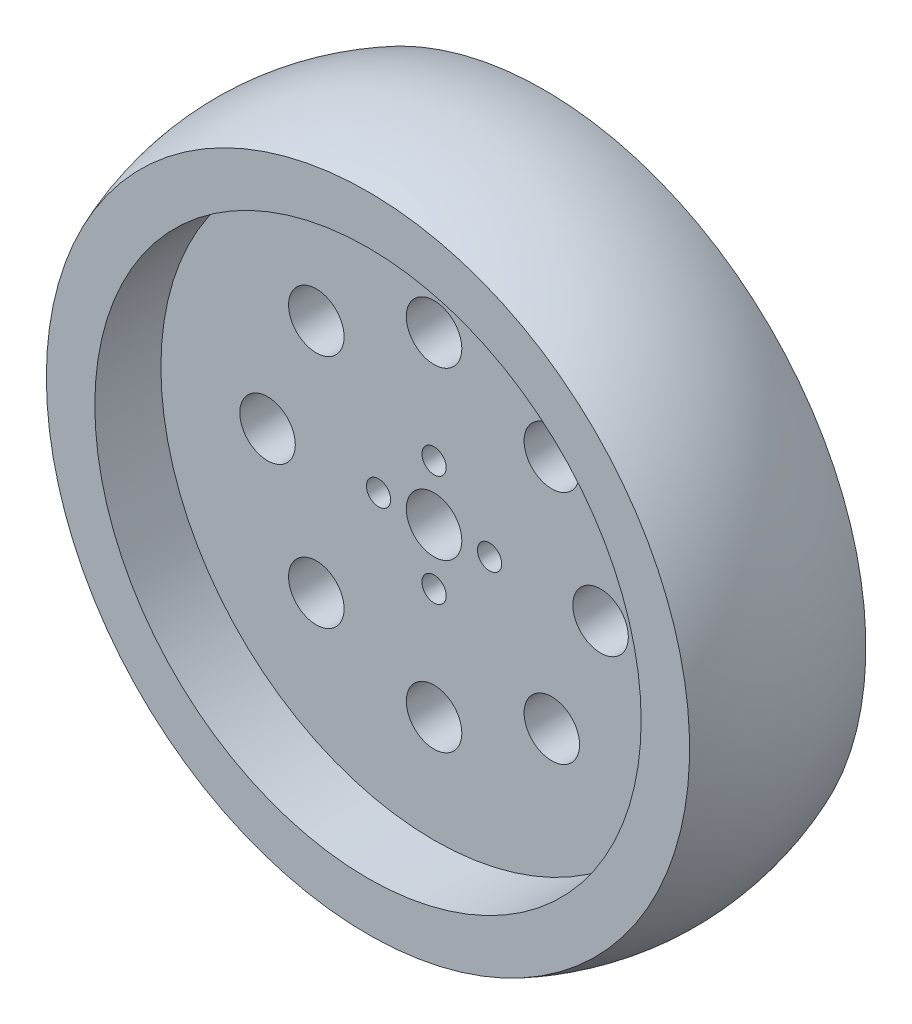
ISO-10303-21;
HEADER;
FILE_DESCRIPTION(('STEP AP214'),'2;1');
FILE_NAME('part.step','',(''),(''),'','','');
FILE_SCHEMA(('AUTOMOTIVE_DESIGN { 1 0 10303 214 1 1 1 1 }'));
ENDSEC;
DATA;
#1=APPLICATION_CONTEXT('core data for automotive mechanical design processes');
#2=APPLICATION_PROTOCOL_DEFINITION('international standard','automotive_design',2000,#1);
#3=PRODUCT_CONTEXT('',#1,'mechanical');
#4=PRODUCT('Part','Part','',(#3));
#5=PRODUCT_RELATED_PRODUCT_CATEGORY('part','',(#4));
#6=PRODUCT_DEFINITION_FORMATION('','',#4);
#7=PRODUCT_DEFINITION_CONTEXT('part definition',#1,'design');
#8=PRODUCT_DEFINITION('design','',#6,#7);
#9=PRODUCT_DEFINITION_SHAPE('','',#8);
#10=(LENGTH_UNIT() NAMED_UNIT(*) SI_UNIT(.MILLI.,.METRE.));
#11=(NAMED_UNIT(*) PLANE_ANGLE_UNIT() SI_UNIT($,.RADIAN.));
#12=(NAMED_UNIT(*) SI_UNIT($,.STERADIAN.) SOLID_ANGLE_UNIT());
#13=UNCERTAINTY_MEASURE_WITH_UNIT(LENGTH_MEASURE(1.E-05),#10,'distance_accuracy_value','');
#14=(GEOMETRIC_REPRESENTATION_CONTEXT(3) GLOBAL_UNCERTAINTY_ASSIGNED_CONTEXT((#13)) GLOBAL_UNIT_ASSIGNED_CONTEXT((#10,
#11,#12)) REPRESENTATION_CONTEXT('',''));
#15=CARTESIAN_POINT('',(0.,0.,0.));
#16=DIRECTION('',(0.,0.,1.));
#17=DIRECTION('',(1.,0.,0.));
#18=AXIS2_PLACEMENT_3D('',#15,#16,#17);
#19=CARTESIAN_POINT('',(-25.2639135472918,11.9697290917884,-7.500634435137));
#20=DIRECTION('',(0.,0.,-1.));
#21=DIRECTION('',(-1.,0.,0.));
#22=AXIS2_PLACEMENT_3D('',#19,#20,#21);
#23=PLANE('',#22);
#24=CARTESIAN_POINT('',(-25.2639135472918,11.9697290917884,-7.500634435137));
#25=DIRECTION('',(0.,0.,-1.));
#26=DIRECTION('',(-1.,0.,0.));
#27=AXIS2_PLACEMENT_3D('',#24,#25,#26);
#28=CIRCLE('',#27,46.355);
#29=CARTESIAN_POINT('',(-71.6189135472918,11.9697290917884,-7.500634435137));
#30=VERTEX_POINT('',#29);
#31=EDGE_CURVE('E310',#30,#30,#28,.F.);
#32=ORIENTED_EDGE('',*,*,#31,.F.);
#33=EDGE_LOOP('',(#32));
#34=FACE_BOUND('',#33,.T.);
#35=CARTESIAN_POINT('',(-25.2639135472918,11.9697290917884,-7.500634435137));
#36=DIRECTION('',(0.,0.,-1.));
#37=DIRECTION('',(-1.,0.,0.));
#38=AXIS2_PLACEMENT_3D('',#35,#36,#37);
#39=CIRCLE('',#38,39.37);
#40=CARTESIAN_POINT('',(-64.6339135472918,11.9697290917884,-7.500634435137));
#41=VERTEX_POINT('',#40);
#42=EDGE_CURVE('E52',#41,#41,#39,.F.);
#43=ORIENTED_EDGE('',*,*,#42,.T.);
#44=EDGE_LOOP('',(#43));
#45=FACE_BOUND('',#44,.T.);
#46=ADVANCED_FACE('F19',(#34,#45),#23,.T.);
#47=CARTESIAN_POINT('',(-25.2639135472918,11.9697290917884,2.024365564863));
#48=DIRECTION('',(0.,0.,-1.));
#49=DIRECTION('',(-1.,0.,0.));
#50=AXIS2_PLACEMENT_3D('',#47,#48,#49);
#51=CYLINDRICAL_SURFACE('',#50,39.37);
#52=ORIENTED_EDGE('',*,*,#42,.F.);
#53=EDGE_LOOP('',(#52));
#54=FACE_BOUND('',#53,.T.);
#55=CARTESIAN_POINT('',(-25.2639135472918,11.9697290917884,2.024365564863));
#56=DIRECTION('',(0.,0.,-1.));
#57=DIRECTION('',(-1.,0.,0.));
#58=AXIS2_PLACEMENT_3D('',#55,#56,#57);
#59=CIRCLE('',#58,39.37);
#60=CARTESIAN_POINT('',(-64.6339135472918,11.9697290917884,2.024365564863));
#61=VERTEX_POINT('',#60);
#62=EDGE_CURVE('E315',#61,#61,#59,.T.);
#63=ORIENTED_EDGE('',*,*,#62,.F.);
#64=EDGE_LOOP('',(#63));
#65=FACE_BOUND('',#64,.T.);
#66=ADVANCED_FACE('F266',(#54,#65),#51,.F.);
#67=CARTESIAN_POINT('',(-39.8428470821046,11.9697290917884,5.19936556486302));
#68=DIRECTION('',(0.,1.,0.));
#69=DIRECTION('',(-1.,0.,0.));
#70=AXIS2_PLACEMENT_3D('',#67,#68,#69);
#71=CIRCLE('',#70,34.22);
#72=TRIMMED_CURVE('',#71,(PARAMETER_VALUE(-2.01090243333378)),
(PARAMETER_VALUE(2.01090243333378)),.T.,.PARAMETER.);
#73=CARTESIAN_POINT('',(-25.2639135472918,11.9697290917884,5.19936556486302));
#74=DIRECTION('',(0.,0.,-1.));
#75=AXIS1_PLACEMENT('',#73,#74);
#76=SURFACE_OF_REVOLUTION('',#72,#75);
#77=CARTESIAN_POINT('',(-25.2639135472918,11.9697290917884,17.899365564863));
#78=DIRECTION('',(0.,0.,-1.));
#79=DIRECTION('',(-1.,0.,0.));
#80=AXIS2_PLACEMENT_3D('',#77,#78,#79);
#81=CIRCLE('',#80,46.355);
#82=CARTESIAN_POINT('',(-71.6189135472919,11.9697290917884,17.899365564863));
#83=VERTEX_POINT('',#82);
#84=EDGE_CURVE('E319',#83,#83,#81,.F.);
#85=ORIENTED_EDGE('',*,*,#84,.F.);
#86=EDGE_LOOP('',(#85));
#87=FACE_BOUND('',#86,.T.);
#88=ORIENTED_EDGE('',*,*,#31,.T.);
#89=EDGE_LOOP('',(#88));
#90=FACE_BOUND('',#89,.T.);
#91=ADVANCED_FACE('F256',(#87,#90),#76,.F.);
#92=CARTESIAN_POINT('',(-25.2639135472918,11.9697290917884,2.024365564863));
#93=DIRECTION('',(0.,0.,-1.));
#94=DIRECTION('',(-1.,0.,0.));
#95=AXIS2_PLACEMENT_3D('',#92,#93,#94);
#96=PLANE('',#95);
#97=ORIENTED_EDGE('',*,*,#62,.T.);
#98=EDGE_LOOP('',(#97));
#99=FACE_BOUND('',#98,.T.);
#100=CARTESIAN_POINT('',(-25.2639135472918,11.9697290917884,2.024365564863));
#101=DIRECTION('',(0.,0.,1.));
#102=DIRECTION('',(1.,0.,0.));
#103=AXIS2_PLACEMENT_3D('',#100,#101,#102);
#104=CIRCLE('',#103,4.);
#105=CARTESIAN_POINT('',(-21.2639135472918,11.9697290917884,2.024365564863));
#106=VERTEX_POINT('',#105);
#107=EDGE_CURVE('E373',#106,#106,#104,.T.);
#108=ORIENTED_EDGE('',*,*,#107,.T.);
#109=EDGE_LOOP('',(#108));
#110=FACE_BOUND('',#109,.T.);
#111=CARTESIAN_POINT('',(-25.2639135472918,19.9697290917884,2.024365564863));
#112=DIRECTION('',(0.,0.,1.));
#113=DIRECTION('',(1.,0.,0.));
#114=AXIS2_PLACEMENT_3D('',#111,#112,#113);
#115=CIRCLE('',#114,1.75);
#116=CARTESIAN_POINT('',(-23.5139135472919,19.9697290917884,2.024365564863));
#117=VERTEX_POINT('',#116);
#118=EDGE_CURVE('E369',#117,#117,#115,.T.);
#119=ORIENTED_EDGE('',*,*,#118,.T.);
#120=EDGE_LOOP('',(#119));
#121=FACE_BOUND('',#120,.T.);
#122=CARTESIAN_POINT('',(-17.2639135472918,11.9697290917884,2.024365564863));
#123=DIRECTION('',(0.,0.,1.));
#124=DIRECTION('',(1.,0.,0.));
#125=AXIS2_PLACEMENT_3D('',#122,#123,#124);
#126=CIRCLE('',#125,1.75);
#127=CARTESIAN_POINT('',(-15.5139135472918,11.9697290917884,2.024365564863));
#128=VERTEX_POINT('',#127);
#129=EDGE_CURVE('E365',#128,#128,#126,.T.);
#130=ORIENTED_EDGE('',*,*,#129,.T.);
#131=EDGE_LOOP('',(#130));
#132=FACE_BOUND('',#131,.T.);
#133=CARTESIAN_POINT('',(-25.2639135472918,3.96972909178839,2.024365564863));
#134=DIRECTION('',(0.,0.,1.));
#135=DIRECTION('',(1.,0.,0.));
#136=AXIS2_PLACEMENT_3D('',#133,#134,#135);
#137=CIRCLE('',#136,1.75);
#138=CARTESIAN_POINT('',(-23.5139135472919,3.96972909178839,2.024365564863));
#139=VERTEX_POINT('',#138);
#140=EDGE_CURVE('E361',#139,#139,#137,.T.);
#141=ORIENTED_EDGE('',*,*,#140,.T.);
#142=EDGE_LOOP('',(#141));
#143=FACE_BOUND('',#142,.T.);
#144=CARTESIAN_POINT('',(-33.2639135472918,11.9697290917884,2.024365564863));
#145=DIRECTION('',(0.,0.,1.));
#146=DIRECTION('',(1.,0.,0.));
#147=AXIS2_PLACEMENT_3D('',#144,#145,#146);
#148=CIRCLE('',#147,1.75);
#149=CARTESIAN_POINT('',(-31.5139135472918,11.9697290917884,2.024365564863));
#150=VERTEX_POINT('',#149);
#151=EDGE_CURVE('E357',#150,#150,#148,.T.);
#152=ORIENTED_EDGE('',*,*,#151,.T.);
#153=EDGE_LOOP('',(#152));
#154=FACE_BOUND('',#153,.T.);
#155=CARTESIAN_POINT('',(-25.2639135472918,35.9697290917884,2.024365564863));
#156=DIRECTION('',(0.,0.,1.));
#157=DIRECTION('',(1.,0.,0.));
#158=AXIS2_PLACEMENT_3D('',#155,#156,#157);
#159=CIRCLE('',#158,4.);
#160=CARTESIAN_POINT('',(-21.2639135472918,35.9697290917884,2.024365564863));
#161=VERTEX_POINT('',#160);
#162=EDGE_CURVE('E353',#161,#161,#159,.T.);
#163=ORIENTED_EDGE('',*,*,#162,.T.);
#164=EDGE_LOOP('',(#163));
#165=FACE_BOUND('',#164,.T.);
#166=CARTESIAN_POINT('',(-1.26391354729185,11.9697290917884,2.024365564863));
#167=DIRECTION('',(0.,0.,1.));
#168=DIRECTION('',(1.,0.,0.));
#169=AXIS2_PLACEMENT_3D('',#166,#167,#168);
#170=CIRCLE('',#169,4.00000000000001);
#171=CARTESIAN_POINT('',(2.73608645270816,11.9697290917884,2.024365564863));
#172=VERTEX_POINT('',#171);
#173=EDGE_CURVE('E349',#172,#172,#170,.T.);
#174=ORIENTED_EDGE('',*,*,#173,.T.);
#175=EDGE_LOOP('',(#174));
#176=FACE_BOUND('',#175,.T.);
#177=CARTESIAN_POINT('',(-25.2639135472918,-12.0302709082116,2.024365564863));
#178=DIRECTION('',(0.,0.,1.));
#179=DIRECTION('',(1.,0.,0.));
#180=AXIS2_PLACEMENT_3D('',#177,#178,#179);
#181=CIRCLE('',#180,4.);
#182=CARTESIAN_POINT('',(-21.2639135472918,-12.0302709082116,2.024365564863));
#183=VERTEX_POINT('',#182);
#184=EDGE_CURVE('E345',#183,#183,#181,.T.);
#185=ORIENTED_EDGE('',*,*,#184,.T.);
#186=EDGE_LOOP('',(#185));
#187=FACE_BOUND('',#186,.T.);
#188=CARTESIAN_POINT('',(-49.2639135472918,11.9697290917884,2.024365564863));
#189=DIRECTION('',(0.,0.,1.));
#190=DIRECTION('',(1.,0.,0.));
#191=AXIS2_PLACEMENT_3D('',#188,#189,#190);
#192=CIRCLE('',#191,4.);
#193=CARTESIAN_POINT('',(-45.2639135472919,11.9697290917884,2.024365564863));
#194=VERTEX_POINT('',#193);
#195=EDGE_CURVE('E341',#194,#194,#192,.T.);
#196=ORIENTED_EDGE('',*,*,#195,.T.);
#197=EDGE_LOOP('',(#196));
#198=FACE_BOUND('',#197,.T.);
#199=CARTESIAN_POINT('',(-8.29335079881471,28.9402918402655,2.024365564863));
#200=DIRECTION('',(0.,0.,1.));
#201=DIRECTION('',(1.,0.,0.));
#202=AXIS2_PLACEMENT_3D('',#199,#200,#201);
#203=CIRCLE('',#202,4.);
#204=CARTESIAN_POINT('',(-4.29335079881471,28.9402918402655,2.024365564863));
#205=VERTEX_POINT('',#204);
#206=EDGE_CURVE('E337',#205,#205,#203,.T.);
#207=ORIENTED_EDGE('',*,*,#206,.T.);
#208=EDGE_LOOP('',(#207));
#209=FACE_BOUND('',#208,.T.);
#210=CARTESIAN_POINT('',(-8.29335079881471,-5.00083365668874,2.024365564863));
#211=DIRECTION('',(0.,0.,1.));
#212=DIRECTION('',(1.,0.,0.));
#213=AXIS2_PLACEMENT_3D('',#210,#211,#212);
#214=CIRCLE('',#213,4.);
#215=CARTESIAN_POINT('',(-4.29335079881471,-5.00083365668874,2.024365564863));
#216=VERTEX_POINT('',#215);
#217=EDGE_CURVE('E333',#216,#216,#214,.T.);
#218=ORIENTED_EDGE('',*,*,#217,.T.);
#219=EDGE_LOOP('',(#218));
#220=FACE_BOUND('',#219,.T.);
#221=CARTESIAN_POINT('',(-42.234476295769,-5.00083365668874,2.024365564863));
#222=DIRECTION('',(0.,0.,1.));
#223=DIRECTION('',(1.,0.,0.));
#224=AXIS2_PLACEMENT_3D('',#221,#222,#223);
#225=CIRCLE('',#224,4.);
#226=CARTESIAN_POINT('',(-38.234476295769,-5.00083365668874,2.024365564863));
#227=VERTEX_POINT('',#226);
#228=EDGE_CURVE('E329',#227,#227,#225,.T.);
#229=ORIENTED_EDGE('',*,*,#228,.T.);
#230=EDGE_LOOP('',(#229));
#231=FACE_BOUND('',#230,.T.);
#232=CARTESIAN_POINT('',(-42.234476295769,28.9402918402655,2.024365564863));
#233=DIRECTION('',(0.,0.,1.));
#234=DIRECTION('',(1.,0.,0.));
#235=AXIS2_PLACEMENT_3D('',#232,#233,#234);
#236=CIRCLE('',#235,4.);
#237=CARTESIAN_POINT('',(-38.234476295769,28.9402918402655,2.024365564863));
#238=VERTEX_POINT('',#237);
#239=EDGE_CURVE('E325',#238,#238,#236,.T.);
#240=ORIENTED_EDGE('',*,*,#239,.T.);
#241=EDGE_LOOP('',(#240));
#242=FACE_BOUND('',#241,.T.);
#243=ADVANCED_FACE('F247',(#99,#110,#121,#132,#143,#154,#165,#176,#187,#198,#209,#220,#231,
#242),#96,.T.);
#244=CARTESIAN_POINT('',(-25.2639135472918,11.9697290917884,17.899365564863));
#245=DIRECTION('',(0.,0.,1.));
#246=DIRECTION('',(1.,0.,0.));
#247=AXIS2_PLACEMENT_3D('',#244,#245,#246);
#248=PLANE('',#247);
#249=ORIENTED_EDGE('',*,*,#84,.T.);
#250=EDGE_LOOP('',(#249));
#251=FACE_BOUND('',#250,.T.);
#252=CARTESIAN_POINT('',(-25.2639135472918,11.9697290917884,17.899365564863));
#253=DIRECTION('',(0.,0.,1.));
#254=DIRECTION('',(1.,0.,0.));
#255=AXIS2_PLACEMENT_3D('',#252,#253,#254);
#256=CIRCLE('',#255,39.37);
#257=CARTESIAN_POINT('',(14.1060864527081,11.9697290917884,17.899365564863));
#258=VERTEX_POINT('',#257);
#259=EDGE_CURVE('E377',#258,#258,#256,.F.);
#260=ORIENTED_EDGE('',*,*,#259,.T.);
#261=EDGE_LOOP('',(#260));
#262=FACE_BOUND('',#261,.T.);
#263=ADVANCED_FACE('F238',(#251,#262),#248,.T.);
#264=CARTESIAN_POINT('',(-42.234476295769,28.9402918402655,-7.50063443513699));
#265=DIRECTION('',(0.,0.,1.));
#266=DIRECTION('',(1.,0.,0.));
#267=AXIS2_PLACEMENT_3D('',#264,#265,#266);
#268=CYLINDRICAL_SURFACE('',#267,4.);
#269=CARTESIAN_POINT('',(-42.234476295769,28.9402918402655,8.37436556486301));
#270=DIRECTION('',(0.,0.,1.));
#271=DIRECTION('',(1.,0.,0.));
#272=AXIS2_PLACEMENT_3D('',#269,#270,#271);
#273=CIRCLE('',#272,4.);
#274=CARTESIAN_POINT('',(-38.234476295769,28.9402918402655,8.37436556486301));
#275=VERTEX_POINT('',#274);
#276=EDGE_CURVE('E381',#275,#275,#273,.F.);
#277=ORIENTED_EDGE('',*,*,#276,.F.);
#278=EDGE_LOOP('',(#277));
#279=FACE_BOUND('',#278,.T.);
#280=ORIENTED_EDGE('',*,*,#239,.F.);
#281=EDGE_LOOP('',(#280));
#282=FACE_BOUND('',#281,.T.);
#283=ADVANCED_FACE('F229',(#279,#282),#268,.F.);
#284=CARTESIAN_POINT('',(-42.234476295769,-5.00083365668874,-7.50063443513699));
#285=DIRECTION('',(0.,0.,1.));
#286=DIRECTION('',(1.,0.,0.));
#287=AXIS2_PLACEMENT_3D('',#284,#285,#286);
#288=CYLINDRICAL_SURFACE('',#287,4.);
#289=CARTESIAN_POINT('',(-42.234476295769,-5.00083365668874,8.37436556486301));
#290=DIRECTION('',(0.,0.,1.));
#291=DIRECTION('',(1.,0.,0.));
#292=AXIS2_PLACEMENT_3D('',#289,#290,#291);
#293=CIRCLE('',#292,4.);
#294=CARTESIAN_POINT('',(-38.234476295769,-5.00083365668874,8.37436556486301));
#295=VERTEX_POINT('',#294);
#296=EDGE_CURVE('E385',#295,#295,#293,.F.);
#297=ORIENTED_EDGE('',*,*,#296,.F.);
#298=EDGE_LOOP('',(#297));
#299=FACE_BOUND('',#298,.T.);
#300=ORIENTED_EDGE('',*,*,#228,.F.);
#301=EDGE_LOOP('',(#300));
#302=FACE_BOUND('',#301,.T.);
#303=ADVANCED_FACE('F220',(#299,#302),#288,.F.);
#304=CARTESIAN_POINT('',(-8.29335079881471,-5.00083365668874,-7.50063443513699));
#305=DIRECTION('',(0.,0.,1.));
#306=DIRECTION('',(1.,0.,0.));
#307=AXIS2_PLACEMENT_3D('',#304,#305,#306);
#308=CYLINDRICAL_SURFACE('',#307,4.);
#309=CARTESIAN_POINT('',(-8.29335079881471,-5.00083365668874,8.37436556486301));
#310=DIRECTION('',(0.,0.,1.));
#311=DIRECTION('',(1.,0.,0.));
#312=AXIS2_PLACEMENT_3D('',#309,#310,#311);
#313=CIRCLE('',#312,4.);
#314=CARTESIAN_POINT('',(-4.29335079881471,-5.00083365668874,8.37436556486301));
#315=VERTEX_POINT('',#314);
#316=EDGE_CURVE('E389',#315,#315,#313,.F.);
#317=ORIENTED_EDGE('',*,*,#316,.F.);
#318=EDGE_LOOP('',(#317));
#319=FACE_BOUND('',#318,.T.);
#320=ORIENTED_EDGE('',*,*,#217,.F.);
#321=EDGE_LOOP('',(#320));
#322=FACE_BOUND('',#321,.T.);
#323=ADVANCED_FACE('F211',(#319,#322),#308,.F.);
#324=CARTESIAN_POINT('',(-8.29335079881471,28.9402918402655,-7.50063443513699));
#325=DIRECTION('',(0.,0.,1.));
#326=DIRECTION('',(1.,0.,0.));
#327=AXIS2_PLACEMENT_3D('',#324,#325,#326);
#328=CYLINDRICAL_SURFACE('',#327,4.);
#329=CARTESIAN_POINT('',(-8.29335079881471,28.9402918402655,8.37436556486301));
#330=DIRECTION('',(0.,0.,1.));
#331=DIRECTION('',(1.,0.,0.));
#332=AXIS2_PLACEMENT_3D('',#329,#330,#331);
#333=CIRCLE('',#332,4.);
#334=CARTESIAN_POINT('',(-4.29335079881471,28.9402918402655,8.37436556486301));
#335=VERTEX_POINT('',#334);
#336=EDGE_CURVE('E393',#335,#335,#333,.F.);
#337=ORIENTED_EDGE('',*,*,#336,.F.);
#338=EDGE_LOOP('',(#337));
#339=FACE_BOUND('',#338,.T.);
#340=ORIENTED_EDGE('',*,*,#206,.F.);
#341=EDGE_LOOP('',(#340));
#342=FACE_BOUND('',#341,.T.);
#343=ADVANCED_FACE('F202',(#339,#342),#328,.F.);
#344=CARTESIAN_POINT('',(-49.2639135472918,11.9697290917884,-7.50063443513699));
#345=DIRECTION('',(0.,0.,1.));
#346=DIRECTION('',(1.,0.,0.));
#347=AXIS2_PLACEMENT_3D('',#344,#345,#346);
#348=CYLINDRICAL_SURFACE('',#347,4.);
#349=CARTESIAN_POINT('',(-49.2639135472918,11.9697290917884,8.37436556486301));
#350=DIRECTION('',(0.,0.,1.));
#351=DIRECTION('',(1.,0.,0.));
#352=AXIS2_PLACEMENT_3D('',#349,#350,#351);
#353=CIRCLE('',#352,4.);
#354=CARTESIAN_POINT('',(-45.2639135472919,11.9697290917884,8.37436556486301));
#355=VERTEX_POINT('',#354);
#356=EDGE_CURVE('E397',#355,#355,#353,.F.);
#357=ORIENTED_EDGE('',*,*,#356,.F.);
#358=EDGE_LOOP('',(#357));
#359=FACE_BOUND('',#358,.T.);
#360=ORIENTED_EDGE('',*,*,#195,.F.);
#361=EDGE_LOOP('',(#360));
#362=FACE_BOUND('',#361,.T.);
#363=ADVANCED_FACE('F193',(#359,#362),#348,.F.);
#364=CARTESIAN_POINT('',(-25.2639135472918,-12.0302709082116,-7.50063443513699));
#365=DIRECTION('',(0.,0.,1.));
#366=DIRECTION('',(1.,0.,0.));
#367=AXIS2_PLACEMENT_3D('',#364,#365,#366);
#368=CYLINDRICAL_SURFACE('',#367,4.);
#369=CARTESIAN_POINT('',(-25.2639135472918,-12.0302709082116,8.37436556486301));
#370=DIRECTION('',(0.,0.,1.));
#371=DIRECTION('',(1.,0.,0.));
#372=AXIS2_PLACEMENT_3D('',#369,#370,#371);
#373=CIRCLE('',#372,4.);
#374=CARTESIAN_POINT('',(-21.2639135472918,-12.0302709082116,8.37436556486301));
#375=VERTEX_POINT('',#374);
#376=EDGE_CURVE('E401',#375,#375,#373,.F.);
#377=ORIENTED_EDGE('',*,*,#376,.F.);
#378=EDGE_LOOP('',(#377));
#379=FACE_BOUND('',#378,.T.);
#380=ORIENTED_EDGE('',*,*,#184,.F.);
#381=EDGE_LOOP('',(#380));
#382=FACE_BOUND('',#381,.T.);
#383=ADVANCED_FACE('F184',(#379,#382),#368,.F.);
#384=CARTESIAN_POINT('',(-1.26391354729185,11.9697290917884,-7.50063443513699));
#385=DIRECTION('',(0.,0.,1.));
#386=DIRECTION('',(1.,0.,0.));
#387=AXIS2_PLACEMENT_3D('',#384,#385,#386);
#388=CYLINDRICAL_SURFACE('',#387,4.00000000000001);
#389=CARTESIAN_POINT('',(-1.26391354729185,11.9697290917884,8.37436556486301));
#390=DIRECTION('',(0.,0.,1.));
#391=DIRECTION('',(1.,0.,0.));
#392=AXIS2_PLACEMENT_3D('',#389,#390,#391);
#393=CIRCLE('',#392,4.00000000000001);
#394=CARTESIAN_POINT('',(2.73608645270816,11.9697290917884,8.37436556486301));
#395=VERTEX_POINT('',#394);
#396=EDGE_CURVE('E405',#395,#395,#393,.F.);
#397=ORIENTED_EDGE('',*,*,#396,.F.);
#398=EDGE_LOOP('',(#397));
#399=FACE_BOUND('',#398,.T.);
#400=ORIENTED_EDGE('',*,*,#173,.F.);
#401=EDGE_LOOP('',(#400));
#402=FACE_BOUND('',#401,.T.);
#403=ADVANCED_FACE('F175',(#399,#402),#388,.F.);
#404=CARTESIAN_POINT('',(-25.2639135472918,35.9697290917884,-7.50063443513699));
#405=DIRECTION('',(0.,0.,1.));
#406=DIRECTION('',(1.,0.,0.));
#407=AXIS2_PLACEMENT_3D('',#404,#405,#406);
#408=CYLINDRICAL_SURFACE('',#407,4.);
#409=CARTESIAN_POINT('',(-25.2639135472918,35.9697290917884,8.37436556486301));
#410=DIRECTION('',(0.,0.,1.));
#411=DIRECTION('',(1.,0.,0.));
#412=AXIS2_PLACEMENT_3D('',#409,#410,#411);
#413=CIRCLE('',#412,4.);
#414=CARTESIAN_POINT('',(-21.2639135472918,35.9697290917884,8.37436556486301));
#415=VERTEX_POINT('',#414);
#416=EDGE_CURVE('E409',#415,#415,#413,.F.);
#417=ORIENTED_EDGE('',*,*,#416,.F.);
#418=EDGE_LOOP('',(#417));
#419=FACE_BOUND('',#418,.T.);
#420=ORIENTED_EDGE('',*,*,#162,.F.);
#421=EDGE_LOOP('',(#420));
#422=FACE_BOUND('',#421,.T.);
#423=ADVANCED_FACE('F166',(#419,#422),#408,.F.);
#424=CARTESIAN_POINT('',(-33.2639135472918,11.9697290917884,-7.50063443513699));
#425=DIRECTION('',(0.,0.,1.));
#426=DIRECTION('',(1.,0.,0.));
#427=AXIS2_PLACEMENT_3D('',#424,#425,#426);
#428=CYLINDRICAL_SURFACE('',#427,1.75);
#429=CARTESIAN_POINT('',(-33.2639135472918,11.9697290917884,8.37436556486301));
#430=DIRECTION('',(0.,0.,1.));
#431=DIRECTION('',(1.,0.,0.));
#432=AXIS2_PLACEMENT_3D('',#429,#430,#431);
#433=CIRCLE('',#432,1.75);
#434=CARTESIAN_POINT('',(-31.5139135472918,11.9697290917884,8.37436556486301));
#435=VERTEX_POINT('',#434);
#436=EDGE_CURVE('E413',#435,#435,#433,.F.);
#437=ORIENTED_EDGE('',*,*,#436,.F.);
#438=EDGE_LOOP('',(#437));
#439=FACE_BOUND('',#438,.T.);
#440=ORIENTED_EDGE('',*,*,#151,.F.);
#441=EDGE_LOOP('',(#440));
#442=FACE_BOUND('',#441,.T.);
#443=ADVANCED_FACE('F157',(#439,#442),#428,.F.);
#444=CARTESIAN_POINT('',(-25.2639135472918,3.96972909178839,-7.50063443513699));
#445=DIRECTION('',(0.,0.,1.));
#446=DIRECTION('',(1.,0.,0.));
#447=AXIS2_PLACEMENT_3D('',#444,#445,#446);
#448=CYLINDRICAL_SURFACE('',#447,1.75);
#449=CARTESIAN_POINT('',(-25.2639135472918,3.96972909178839,8.37436556486301));
#450=DIRECTION('',(0.,0.,1.));
#451=DIRECTION('',(1.,0.,0.));
#452=AXIS2_PLACEMENT_3D('',#449,#450,#451);
#453=CIRCLE('',#452,1.75);
#454=CARTESIAN_POINT('',(-23.5139135472919,3.96972909178839,8.37436556486301));
#455=VERTEX_POINT('',#454);
#456=EDGE_CURVE('E417',#455,#455,#453,.F.);
#457=ORIENTED_EDGE('',*,*,#456,.F.);
#458=EDGE_LOOP('',(#457));
#459=FACE_BOUND('',#458,.T.);
#460=ORIENTED_EDGE('',*,*,#140,.F.);
#461=EDGE_LOOP('',(#460));
#462=FACE_BOUND('',#461,.T.);
#463=ADVANCED_FACE('F148',(#459,#462),#448,.F.);
#464=CARTESIAN_POINT('',(-17.2639135472918,11.9697290917884,-7.50063443513699));
#465=DIRECTION('',(0.,0.,1.));
#466=DIRECTION('',(1.,0.,0.));
#467=AXIS2_PLACEMENT_3D('',#464,#465,#466);
#468=CYLINDRICAL_SURFACE('',#467,1.75);
#469=CARTESIAN_POINT('',(-17.2639135472918,11.9697290917884,8.37436556486301));
#470=DIRECTION('',(0.,0.,1.));
#471=DIRECTION('',(1.,0.,0.));
#472=AXIS2_PLACEMENT_3D('',#469,#470,#471);
#473=CIRCLE('',#472,1.75);
#474=CARTESIAN_POINT('',(-15.5139135472918,11.9697290917884,8.37436556486301));
#475=VERTEX_POINT('',#474);
#476=EDGE_CURVE('E421',#475,#475,#473,.F.);
#477=ORIENTED_EDGE('',*,*,#476,.F.);
#478=EDGE_LOOP('',(#477));
#479=FACE_BOUND('',#478,.T.);
#480=ORIENTED_EDGE('',*,*,#129,.F.);
#481=EDGE_LOOP('',(#480));
#482=FACE_BOUND('',#481,.T.);
#483=ADVANCED_FACE('F139',(#479,#482),#468,.F.);
#484=CARTESIAN_POINT('',(-25.2639135472918,19.9697290917884,-7.50063443513699));
#485=DIRECTION('',(0.,0.,1.));
#486=DIRECTION('',(1.,0.,0.));
#487=AXIS2_PLACEMENT_3D('',#484,#485,#486);
#488=CYLINDRICAL_SURFACE('',#487,1.75);
#489=CARTESIAN_POINT('',(-25.2639135472918,19.9697290917884,8.37436556486301));
#490=DIRECTION('',(0.,0.,1.));
#491=DIRECTION('',(1.,0.,0.));
#492=AXIS2_PLACEMENT_3D('',#489,#490,#491);
#493=CIRCLE('',#492,1.75);
#494=CARTESIAN_POINT('',(-23.5139135472919,19.9697290917884,8.37436556486301));
#495=VERTEX_POINT('',#494);
#496=EDGE_CURVE('E425',#495,#495,#493,.F.);
#497=ORIENTED_EDGE('',*,*,#496,.F.);
#498=EDGE_LOOP('',(#497));
#499=FACE_BOUND('',#498,.T.);
#500=ORIENTED_EDGE('',*,*,#118,.F.);
#501=EDGE_LOOP('',(#500));
#502=FACE_BOUND('',#501,.T.);
#503=ADVANCED_FACE('F130',(#499,#502),#488,.F.);
#504=CARTESIAN_POINT('',(-25.2639135472918,11.9697290917884,-7.50063443513699));
#505=DIRECTION('',(0.,0.,1.));
#506=DIRECTION('',(1.,0.,0.));
#507=AXIS2_PLACEMENT_3D('',#504,#505,#506);
#508=CYLINDRICAL_SURFACE('',#507,4.);
#509=CARTESIAN_POINT('',(-25.2639135472918,11.9697290917884,8.37436556486301));
#510=DIRECTION('',(0.,0.,1.));
#511=DIRECTION('',(1.,0.,0.));
#512=AXIS2_PLACEMENT_3D('',#509,#510,#511);
#513=CIRCLE('',#512,4.);
#514=CARTESIAN_POINT('',(-21.2639135472918,11.9697290917884,8.37436556486301));
#515=VERTEX_POINT('',#514);
#516=EDGE_CURVE('E30',#515,#515,#513,.F.);
#517=ORIENTED_EDGE('',*,*,#516,.F.);
#518=EDGE_LOOP('',(#517));
#519=FACE_BOUND('',#518,.T.);
#520=ORIENTED_EDGE('',*,*,#107,.F.);
#521=EDGE_LOOP('',(#520));
#522=FACE_BOUND('',#521,.T.);
#523=ADVANCED_FACE('F121',(#519,#522),#508,.F.);
#524=CARTESIAN_POINT('',(-25.2639135472918,11.9697290917884,8.374365564863));
#525=DIRECTION('',(0.,0.,1.));
#526=DIRECTION('',(1.,0.,0.));
#527=AXIS2_PLACEMENT_3D('',#524,#525,#526);
#528=CYLINDRICAL_SURFACE('',#527,39.37);
#529=ORIENTED_EDGE('',*,*,#259,.F.);
#530=EDGE_LOOP('',(#529));
#531=FACE_BOUND('',#530,.T.);
#532=CARTESIAN_POINT('',(-25.2639135472918,11.9697290917884,8.374365564863));
#533=DIRECTION('',(0.,0.,1.));
#534=DIRECTION('',(1.,0.,0.));
#535=AXIS2_PLACEMENT_3D('',#532,#533,#534);
#536=CIRCLE('',#535,39.37);
#537=CARTESIAN_POINT('',(14.1060864527081,11.9697290917884,8.374365564863));
#538=VERTEX_POINT('',#537);
#539=EDGE_CURVE('E11',#538,#538,#536,.T.);
#540=ORIENTED_EDGE('',*,*,#539,.F.);
#541=EDGE_LOOP('',(#540));
#542=FACE_BOUND('',#541,.T.);
#543=ADVANCED_FACE('F114',(#531,#542),#528,.F.);
#544=CARTESIAN_POINT('',(-25.2639135472918,11.9697290917884,8.374365564863));
#545=DIRECTION('',(0.,0.,1.));
#546=DIRECTION('',(1.,0.,0.));
#547=AXIS2_PLACEMENT_3D('',#544,#545,#546);
#548=PLANE('',#547);
#549=ORIENTED_EDGE('',*,*,#539,.T.);
#550=EDGE_LOOP('',(#549));
#551=FACE_BOUND('',#550,.T.);
#552=ORIENTED_EDGE('',*,*,#516,.T.);
#553=EDGE_LOOP('',(#552));
#554=FACE_BOUND('',#553,.T.);
#555=ORIENTED_EDGE('',*,*,#496,.T.);
#556=EDGE_LOOP('',(#555));
#557=FACE_BOUND('',#556,.T.);
#558=ORIENTED_EDGE('',*,*,#476,.T.);
#559=EDGE_LOOP('',(#558));
#560=FACE_BOUND('',#559,.T.);
#561=ORIENTED_EDGE('',*,*,#456,.T.);
#562=EDGE_LOOP('',(#561));
#563=FACE_BOUND('',#562,.T.);
#564=ORIENTED_EDGE('',*,*,#436,.T.);
#565=EDGE_LOOP('',(#564));
#566=FACE_BOUND('',#565,.T.);
#567=ORIENTED_EDGE('',*,*,#416,.T.);
#568=EDGE_LOOP('',(#567));
#569=FACE_BOUND('',#568,.T.);
#570=ORIENTED_EDGE('',*,*,#396,.T.);
#571=EDGE_LOOP('',(#570));
#572=FACE_BOUND('',#571,.T.);
#573=ORIENTED_EDGE('',*,*,#376,.T.);
#574=EDGE_LOOP('',(#573));
#575=FACE_BOUND('',#574,.T.);
#576=ORIENTED_EDGE('',*,*,#356,.T.);
#577=EDGE_LOOP('',(#576));
#578=FACE_BOUND('',#577,.T.);
#579=ORIENTED_EDGE('',*,*,#336,.T.);
#580=EDGE_LOOP('',(#579));
#581=FACE_BOUND('',#580,.T.);
#582=ORIENTED_EDGE('',*,*,#316,.T.);
#583=EDGE_LOOP('',(#582));
#584=FACE_BOUND('',#583,.T.);
#585=ORIENTED_EDGE('',*,*,#296,.T.);
#586=EDGE_LOOP('',(#585));
#587=FACE_BOUND('',#586,.T.);
#588=ORIENTED_EDGE('',*,*,#276,.T.);
#589=EDGE_LOOP('',(#588));
#590=FACE_BOUND('',#589,.T.);
#591=ADVANCED_FACE('F95',(#551,#554,#557,#560,#563,#566,#569,#572,#575,#578,#581,#584,#587,
#590),#548,.T.);
#592=CLOSED_SHELL('',(#46,#66,#91,#243,#263,#283,#303,#323,#343,#363,#383,#403,#423,#443,#463,
#483,#503,#523,#543,#591));
#593=CARTESIAN_POINT('',(-25.2639135472918,11.9697290917884,-5.341634435137));
#594=DIRECTION('',(0.,0.,1.));
#595=DIRECTION('',(1.,0.,0.));
#596=AXIS2_PLACEMENT_3D('',#593,#594,#595);
#597=CYLINDRICAL_SURFACE('',#596,44.45);
#598=CARTESIAN_POINT('',(-25.2639135472918,11.9697290917884,-5.34163443512625));
#599=DIRECTION('',(0.,0.,1.));
#600=DIRECTION('',(1.,0.,2.75819081360317E-13));
#601=AXIS2_PLACEMENT_3D('',#598,#599,#600);
#602=CIRCLE('',#601,44.45);
#603=CARTESIAN_POINT('',(19.1860864527082,11.9697290917884,-5.34163443511399));
#604=VERTEX_POINT('',#603);
#605=EDGE_CURVE('E45',#604,#604,#602,.T.);
#606=ORIENTED_EDGE('',*,*,#605,.T.);
#607=EDGE_LOOP('',(#606));
#608=FACE_BOUND('',#607,.T.);
#609=CARTESIAN_POINT('',(-25.2639135472918,11.9697290917884,15.740365564863));
#610=DIRECTION('',(0.,0.,-1.));
#611=DIRECTION('',(-1.,0.,0.));
#612=AXIS2_PLACEMENT_3D('',#609,#610,#611);
#613=CIRCLE('',#612,44.45);
#614=CARTESIAN_POINT('',(-69.7163133821741,11.9697290917884,15.7403652916824));
#615=VERTEX_POINT('',#614);
#616=CARTESIAN_POINT('',(19.1884862875904,11.9697290917884,15.7403652916824));
#617=VERTEX_POINT('',#616);
#618=EDGE_CURVE('E37',#615,#617,#613,.T.);
#619=ORIENTED_EDGE('',*,*,#618,.T.);
#620=CARTESIAN_POINT('',(-25.2639135472918,11.9697290917884,15.740365564863));
#621=DIRECTION('',(0.,0.,-1.));
#622=DIRECTION('',(1.,0.,0.));
#623=AXIS2_PLACEMENT_3D('',#620,#621,#622);
#624=CIRCLE('',#623,44.45);
#625=EDGE_CURVE('E43',#617,#615,#624,.T.);
#626=ORIENTED_EDGE('',*,*,#625,.T.);
#627=EDGE_LOOP('',(#619,#626));
#628=FACE_BOUND('',#627,.T.);
#629=ADVANCED_FACE('F42',(#608,#628),#597,.T.);
#630=CARTESIAN_POINT('',(-25.2639135472918,11.9697290917884,15.7403650185027));
#631=DIRECTION('',(0.,0.,1.));
#632=DIRECTION('',(1.,0.,0.));
#633=AXIS2_PLACEMENT_3D('',#630,#631,#632);
#634=CONICAL_SURFACE('',#633,44.4547996697645,0.000227666720705138);
#635=ORIENTED_EDGE('',*,*,#625,.F.);
#636=ORIENTED_EDGE('',*,*,#618,.F.);
#637=EDGE_LOOP('',(#635,#636));
#638=FACE_BOUND('',#637,.T.);
#639=ORIENTED_EDGE('',*,*,#605,.F.);
#640=EDGE_LOOP('',(#639));
#641=FACE_BOUND('',#640,.T.);
#642=ADVANCED_FACE('F49',(#638,#641),#634,.F.);
#643=CLOSED_SHELL('',(#629,#642));
#644=ORIENTED_CLOSED_SHELL('',*,#592,.T.);
#645=BREP_WITH_VOIDS('B1',#643,(#644));
#646=ADVANCED_BREP_SHAPE_REPRESENTATION('',(#18,#645),#14);
#647=SHAPE_DEFINITION_REPRESENTATION(#9,#646);
ENDSEC;
END-ISO-10303-21;
